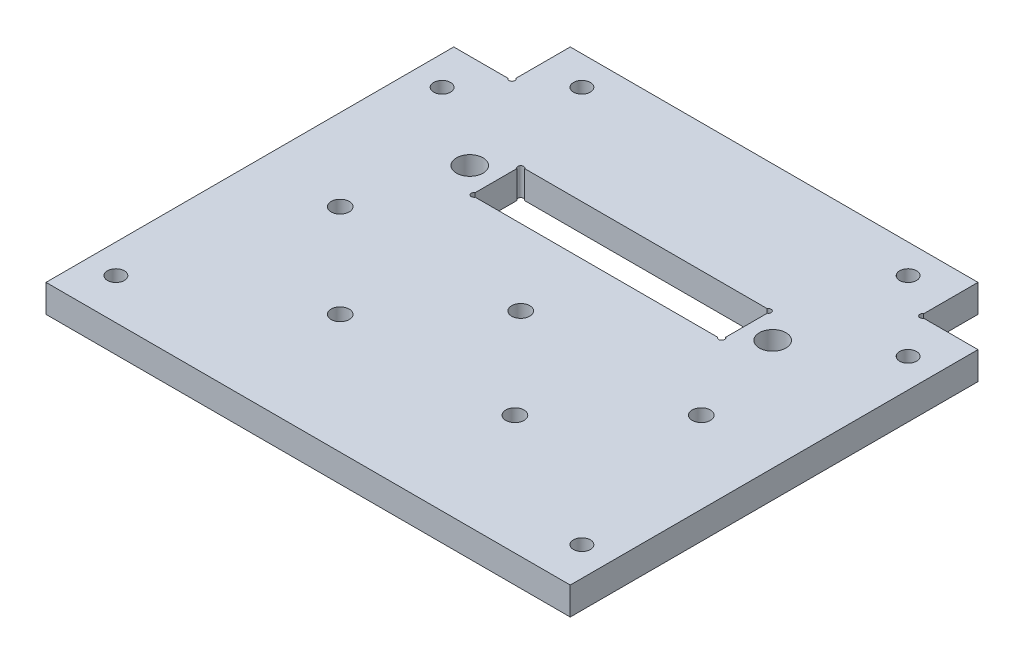
ISO-10303-21;
HEADER;
FILE_DESCRIPTION(('STEP AP214'),'2;1');
FILE_NAME('part.step','',(''),(''),'','','');
FILE_SCHEMA(('AUTOMOTIVE_DESIGN { 1 0 10303 214 1 1 1 1 }'));
ENDSEC;
DATA;
#1=APPLICATION_CONTEXT('core data for automotive mechanical design processes');
#2=APPLICATION_PROTOCOL_DEFINITION('international standard','automotive_design',2000,#1);
#3=PRODUCT_CONTEXT('',#1,'mechanical');
#4=PRODUCT('Part','Part','',(#3));
#5=PRODUCT_RELATED_PRODUCT_CATEGORY('part','',(#4));
#6=PRODUCT_DEFINITION_FORMATION('','',#4);
#7=PRODUCT_DEFINITION_CONTEXT('part definition',#1,'design');
#8=PRODUCT_DEFINITION('design','',#6,#7);
#9=PRODUCT_DEFINITION_SHAPE('','',#8);
#10=(LENGTH_UNIT() NAMED_UNIT(*) SI_UNIT(.MILLI.,.METRE.));
#11=(NAMED_UNIT(*) PLANE_ANGLE_UNIT() SI_UNIT($,.RADIAN.));
#12=(NAMED_UNIT(*) SI_UNIT($,.STERADIAN.) SOLID_ANGLE_UNIT());
#13=UNCERTAINTY_MEASURE_WITH_UNIT(LENGTH_MEASURE(1.E-05),#10,'distance_accuracy_value','');
#14=(GEOMETRIC_REPRESENTATION_CONTEXT(3) GLOBAL_UNCERTAINTY_ASSIGNED_CONTEXT((#13)) GLOBAL_UNIT_ASSIGNED_CONTEXT((#10,
#11,#12)) REPRESENTATION_CONTEXT('',''));
#15=CARTESIAN_POINT('',(0.,0.,0.));
#16=DIRECTION('',(0.,0.,1.));
#17=DIRECTION('',(1.,0.,0.));
#18=AXIS2_PLACEMENT_3D('',#15,#16,#17);
#19=CARTESIAN_POINT('',(-35.,4.7625,-10.));
#20=DIRECTION('',(1.,0.,0.));
#21=DIRECTION('',(0.,0.,-1.));
#22=AXIS2_PLACEMENT_3D('',#19,#20,#21);
#23=PLANE('',#22);
#24=DIRECTION('',(0.,0.,1.));
#25=VECTOR('',#24,1.);
#26=CARTESIAN_POINT('',(-35.,0.,-10.));
#27=LINE('',#26,#25);
#28=CARTESIAN_POINT('',(-35.,0.,-10.));
#29=VERTEX_POINT('',#28);
#30=CARTESIAN_POINT('',(-35.,0.,-0.683012701892218));
#31=VERTEX_POINT('',#30);
#32=EDGE_CURVE('E213',#29,#31,#27,.T.);
#33=ORIENTED_EDGE('',*,*,#32,.T.);
#34=DIRECTION('',(0.,1.,0.));
#35=VECTOR('',#34,1.);
#36=CARTESIAN_POINT('',(-35.,0.,-0.683012701892218));
#37=LINE('',#36,#35);
#38=CARTESIAN_POINT('',(-35.,4.7625,-0.683012701892218));
#39=VERTEX_POINT('',#38);
#40=EDGE_CURVE('E324',#31,#39,#37,.T.);
#41=ORIENTED_EDGE('',*,*,#40,.T.);
#42=DIRECTION('',(0.,0.,1.));
#43=VECTOR('',#42,1.);
#44=CARTESIAN_POINT('',(-35.,4.7625,-10.));
#45=LINE('',#44,#43);
#46=CARTESIAN_POINT('',(-35.,4.7625,-10.));
#47=VERTEX_POINT('',#46);
#48=EDGE_CURVE('E216',#47,#39,#45,.T.);
#49=ORIENTED_EDGE('',*,*,#48,.F.);
#50=DIRECTION('',(0.,-1.,0.));
#51=VECTOR('',#50,1.);
#52=CARTESIAN_POINT('',(-35.,4.7625,-10.));
#53=LINE('',#52,#51);
#54=EDGE_CURVE('E235',#47,#29,#53,.T.);
#55=ORIENTED_EDGE('',*,*,#54,.T.);
#56=EDGE_LOOP('',(#33,#41,#49,#55));
#57=FACE_BOUND('',#56,.T.);
#58=ADVANCED_FACE('F31',(#57),#23,.F.);
#59=CARTESIAN_POINT('',(-35.,4.7625,0.));
#60=DIRECTION('',(0.,0.,1.));
#61=DIRECTION('',(1.,0.,0.));
#62=AXIS2_PLACEMENT_3D('',#59,#60,#61);
#63=PLANE('',#62);
#64=DIRECTION('',(-1.,0.,0.));
#65=VECTOR('',#64,1.);
#66=CARTESIAN_POINT('',(-35.,4.7625,0.));
#67=LINE('',#66,#65);
#68=CARTESIAN_POINT('',(-35.6830127018922,4.7625,0.));
#69=VERTEX_POINT('',#68);
#70=CARTESIAN_POINT('',(-45.,4.7625,0.));
#71=VERTEX_POINT('',#70);
#72=EDGE_CURVE('E219',#69,#71,#67,.T.);
#73=ORIENTED_EDGE('',*,*,#72,.F.);
#74=DIRECTION('',(0.,1.,0.));
#75=VECTOR('',#74,1.);
#76=CARTESIAN_POINT('',(-35.6830127018922,0.,0.));
#77=LINE('',#76,#75);
#78=CARTESIAN_POINT('',(-35.6830127018922,0.,0.));
#79=VERTEX_POINT('',#78);
#80=EDGE_CURVE('E321',#69,#79,#77,.F.);
#81=ORIENTED_EDGE('',*,*,#80,.T.);
#82=DIRECTION('',(-1.,0.,0.));
#83=VECTOR('',#82,1.);
#84=CARTESIAN_POINT('',(-35.,0.,0.));
#85=LINE('',#84,#83);
#86=CARTESIAN_POINT('',(-45.,0.,0.));
#87=VERTEX_POINT('',#86);
#88=EDGE_CURVE('E238',#79,#87,#85,.T.);
#89=ORIENTED_EDGE('',*,*,#88,.T.);
#90=DIRECTION('',(0.,-1.,0.));
#91=VECTOR('',#90,1.);
#92=CARTESIAN_POINT('',(-45.,4.7625,0.));
#93=LINE('',#92,#91);
#94=EDGE_CURVE('E266',#71,#87,#93,.T.);
#95=ORIENTED_EDGE('',*,*,#94,.F.);
#96=EDGE_LOOP('',(#73,#81,#89,#95));
#97=FACE_BOUND('',#96,.T.);
#98=ADVANCED_FACE('F401',(#97),#63,.F.);
#99=CARTESIAN_POINT('',(-45.,4.7625,0.));
#100=DIRECTION('',(1.,0.,0.));
#101=DIRECTION('',(0.,0.,-1.));
#102=AXIS2_PLACEMENT_3D('',#99,#100,#101);
#103=PLANE('',#102);
#104=DIRECTION('',(0.,0.,1.));
#105=VECTOR('',#104,1.);
#106=CARTESIAN_POINT('',(-45.,0.,0.));
#107=LINE('',#106,#105);
#108=CARTESIAN_POINT('',(-45.,0.,70.));
#109=VERTEX_POINT('',#108);
#110=EDGE_CURVE('E240',#87,#109,#107,.T.);
#111=ORIENTED_EDGE('',*,*,#110,.T.);
#112=DIRECTION('',(0.,-1.,0.));
#113=VECTOR('',#112,1.);
#114=CARTESIAN_POINT('',(-45.,4.7625,70.));
#115=LINE('',#114,#113);
#116=CARTESIAN_POINT('',(-45.,4.7625,70.));
#117=VERTEX_POINT('',#116);
#118=EDGE_CURVE('E263',#117,#109,#115,.T.);
#119=ORIENTED_EDGE('',*,*,#118,.F.);
#120=DIRECTION('',(0.,0.,1.));
#121=VECTOR('',#120,1.);
#122=CARTESIAN_POINT('',(-45.,4.7625,0.));
#123=LINE('',#122,#121);
#124=EDGE_CURVE('E222',#71,#117,#123,.T.);
#125=ORIENTED_EDGE('',*,*,#124,.F.);
#126=ORIENTED_EDGE('',*,*,#94,.T.);
#127=EDGE_LOOP('',(#111,#119,#125,#126));
#128=FACE_BOUND('',#127,.T.);
#129=ADVANCED_FACE('F406',(#128),#103,.F.);
#130=CARTESIAN_POINT('',(45.,4.7625,70.));
#131=DIRECTION('',(0.,0.,-1.));
#132=DIRECTION('',(-1.,0.,0.));
#133=AXIS2_PLACEMENT_3D('',#130,#131,#132);
#134=PLANE('',#133);
#135=DIRECTION('',(1.,0.,0.));
#136=VECTOR('',#135,1.);
#137=CARTESIAN_POINT('',(45.,0.,70.));
#138=LINE('',#137,#136);
#139=CARTESIAN_POINT('',(45.,0.,70.));
#140=VERTEX_POINT('',#139);
#141=EDGE_CURVE('E242',#109,#140,#138,.T.);
#142=ORIENTED_EDGE('',*,*,#141,.T.);
#143=DIRECTION('',(0.,-1.,0.));
#144=VECTOR('',#143,1.);
#145=CARTESIAN_POINT('',(45.,4.7625,70.));
#146=LINE('',#145,#144);
#147=CARTESIAN_POINT('',(45.,4.7625,70.));
#148=VERTEX_POINT('',#147);
#149=EDGE_CURVE('E260',#148,#140,#146,.T.);
#150=ORIENTED_EDGE('',*,*,#149,.F.);
#151=DIRECTION('',(1.,0.,0.));
#152=VECTOR('',#151,1.);
#153=CARTESIAN_POINT('',(45.,4.7625,70.));
#154=LINE('',#153,#152);
#155=EDGE_CURVE('E224',#117,#148,#154,.T.);
#156=ORIENTED_EDGE('',*,*,#155,.F.);
#157=ORIENTED_EDGE('',*,*,#118,.T.);
#158=EDGE_LOOP('',(#142,#150,#156,#157));
#159=FACE_BOUND('',#158,.T.);
#160=ADVANCED_FACE('F446',(#159),#134,.F.);
#161=CARTESIAN_POINT('',(45.,4.7625,0.));
#162=DIRECTION('',(-1.,0.,0.));
#163=DIRECTION('',(0.,0.,1.));
#164=AXIS2_PLACEMENT_3D('',#161,#162,#163);
#165=PLANE('',#164);
#166=DIRECTION('',(0.,0.,-1.));
#167=VECTOR('',#166,1.);
#168=CARTESIAN_POINT('',(45.,0.,0.));
#169=LINE('',#168,#167);
#170=CARTESIAN_POINT('',(45.,0.,0.));
#171=VERTEX_POINT('',#170);
#172=EDGE_CURVE('E244',#140,#171,#169,.T.);
#173=ORIENTED_EDGE('',*,*,#172,.T.);
#174=DIRECTION('',(0.,-1.,0.));
#175=VECTOR('',#174,1.);
#176=CARTESIAN_POINT('',(45.,4.7625,0.));
#177=LINE('',#176,#175);
#178=CARTESIAN_POINT('',(45.,4.7625,0.));
#179=VERTEX_POINT('',#178);
#180=EDGE_CURVE('E257',#179,#171,#177,.T.);
#181=ORIENTED_EDGE('',*,*,#180,.F.);
#182=DIRECTION('',(0.,0.,-1.));
#183=VECTOR('',#182,1.);
#184=CARTESIAN_POINT('',(45.,4.7625,0.));
#185=LINE('',#184,#183);
#186=EDGE_CURVE('E226',#148,#179,#185,.T.);
#187=ORIENTED_EDGE('',*,*,#186,.F.);
#188=ORIENTED_EDGE('',*,*,#149,.T.);
#189=EDGE_LOOP('',(#173,#181,#187,#188));
#190=FACE_BOUND('',#189,.T.);
#191=ADVANCED_FACE('F442',(#190),#165,.F.);
#192=CARTESIAN_POINT('',(45.,4.7625,0.));
#193=DIRECTION('',(0.,0.,1.));
#194=DIRECTION('',(1.,0.,0.));
#195=AXIS2_PLACEMENT_3D('',#192,#193,#194);
#196=PLANE('',#195);
#197=DIRECTION('',(-1.,0.,0.));
#198=VECTOR('',#197,1.);
#199=CARTESIAN_POINT('',(45.,0.,0.));
#200=LINE('',#199,#198);
#201=CARTESIAN_POINT('',(35.6830127018922,0.,0.));
#202=VERTEX_POINT('',#201);
#203=EDGE_CURVE('E246',#171,#202,#200,.T.);
#204=ORIENTED_EDGE('',*,*,#203,.T.);
#205=DIRECTION('',(0.,1.,0.));
#206=VECTOR('',#205,1.);
#207=CARTESIAN_POINT('',(35.6830127018922,0.,0.));
#208=LINE('',#207,#206);
#209=CARTESIAN_POINT('',(35.6830127018922,4.7625,0.));
#210=VERTEX_POINT('',#209);
#211=EDGE_CURVE('E300',#202,#210,#208,.T.);
#212=ORIENTED_EDGE('',*,*,#211,.T.);
#213=DIRECTION('',(-1.,0.,0.));
#214=VECTOR('',#213,1.);
#215=CARTESIAN_POINT('',(45.,4.7625,0.));
#216=LINE('',#215,#214);
#217=EDGE_CURVE('E228',#179,#210,#216,.T.);
#218=ORIENTED_EDGE('',*,*,#217,.F.);
#219=ORIENTED_EDGE('',*,*,#180,.T.);
#220=EDGE_LOOP('',(#204,#212,#218,#219));
#221=FACE_BOUND('',#220,.T.);
#222=ADVANCED_FACE('F437',(#221),#196,.F.);
#223=CARTESIAN_POINT('',(35.,4.7625,-10.));
#224=DIRECTION('',(-1.,0.,0.));
#225=DIRECTION('',(0.,0.,1.));
#226=AXIS2_PLACEMENT_3D('',#223,#224,#225);
#227=PLANE('',#226);
#228=DIRECTION('',(0.,0.,-1.));
#229=VECTOR('',#228,1.);
#230=CARTESIAN_POINT('',(35.,4.7625,-10.));
#231=LINE('',#230,#229);
#232=CARTESIAN_POINT('',(35.,4.7625,-0.683012701892218));
#233=VERTEX_POINT('',#232);
#234=CARTESIAN_POINT('',(35.,4.7625,-10.));
#235=VERTEX_POINT('',#234);
#236=EDGE_CURVE('E231',#233,#235,#231,.T.);
#237=ORIENTED_EDGE('',*,*,#236,.F.);
#238=DIRECTION('',(0.,1.,0.));
#239=VECTOR('',#238,1.);
#240=CARTESIAN_POINT('',(35.,0.,-0.683012701892218));
#241=LINE('',#240,#239);
#242=CARTESIAN_POINT('',(35.,0.,-0.683012701892218));
#243=VERTEX_POINT('',#242);
#244=EDGE_CURVE('E296',#233,#243,#241,.F.);
#245=ORIENTED_EDGE('',*,*,#244,.T.);
#246=DIRECTION('',(0.,0.,-1.));
#247=VECTOR('',#246,1.);
#248=CARTESIAN_POINT('',(35.,0.,-10.));
#249=LINE('',#248,#247);
#250=CARTESIAN_POINT('',(35.,0.,-10.));
#251=VERTEX_POINT('',#250);
#252=EDGE_CURVE('E249',#243,#251,#249,.T.);
#253=ORIENTED_EDGE('',*,*,#252,.T.);
#254=DIRECTION('',(0.,-1.,0.));
#255=VECTOR('',#254,1.);
#256=CARTESIAN_POINT('',(35.,4.7625,-10.));
#257=LINE('',#256,#255);
#258=EDGE_CURVE('E254',#235,#251,#257,.T.);
#259=ORIENTED_EDGE('',*,*,#258,.F.);
#260=EDGE_LOOP('',(#237,#245,#253,#259));
#261=FACE_BOUND('',#260,.T.);
#262=ADVANCED_FACE('F432',(#261),#227,.F.);
#263=CARTESIAN_POINT('',(-35.,4.7625,-10.));
#264=DIRECTION('',(0.,0.,1.));
#265=DIRECTION('',(1.,0.,0.));
#266=AXIS2_PLACEMENT_3D('',#263,#264,#265);
#267=PLANE('',#266);
#268=DIRECTION('',(-1.,0.,0.));
#269=VECTOR('',#268,1.);
#270=CARTESIAN_POINT('',(-35.,0.,-10.));
#271=LINE('',#270,#269);
#272=EDGE_CURVE('E220',#251,#29,#271,.T.);
#273=ORIENTED_EDGE('',*,*,#272,.T.);
#274=ORIENTED_EDGE('',*,*,#54,.F.);
#275=DIRECTION('',(-1.,0.,0.));
#276=VECTOR('',#275,1.);
#277=CARTESIAN_POINT('',(-35.,4.7625,-10.));
#278=LINE('',#277,#276);
#279=EDGE_CURVE('E233',#235,#47,#278,.T.);
#280=ORIENTED_EDGE('',*,*,#279,.F.);
#281=ORIENTED_EDGE('',*,*,#258,.T.);
#282=EDGE_LOOP('',(#273,#274,#280,#281));
#283=FACE_BOUND('',#282,.T.);
#284=ADVANCED_FACE('F430',(#283),#267,.F.);
#285=CARTESIAN_POINT('',(-35.,4.7625,0.));
#286=DIRECTION('',(0.,-1.,0.));
#287=DIRECTION('',(0.,0.,-1.));
#288=AXIS2_PLACEMENT_3D('',#285,#286,#287);
#289=PLANE('',#288);
#290=CARTESIAN_POINT('',(28.,4.7625,-5.));
#291=DIRECTION('',(0.,1.,0.));
#292=DIRECTION('',(0.,0.,-1.));
#293=AXIS2_PLACEMENT_3D('',#290,#291,#292);
#294=CIRCLE('',#293,1.45);
#295=CARTESIAN_POINT('',(28.,4.7625,-6.45));
#296=VERTEX_POINT('',#295);
#297=EDGE_CURVE('E327',#296,#296,#294,.T.);
#298=ORIENTED_EDGE('',*,*,#297,.F.);
#299=EDGE_LOOP('',(#298));
#300=FACE_BOUND('',#299,.T.);
#301=CARTESIAN_POINT('',(40.,4.7625,7.));
#302=DIRECTION('',(0.,1.,0.));
#303=DIRECTION('',(0.,0.,-1.));
#304=AXIS2_PLACEMENT_3D('',#301,#302,#303);
#305=CIRCLE('',#304,1.45);
#306=CARTESIAN_POINT('',(40.,4.7625,5.55));
#307=VERTEX_POINT('',#306);
#308=EDGE_CURVE('E331',#307,#307,#305,.T.);
#309=ORIENTED_EDGE('',*,*,#308,.F.);
#310=EDGE_LOOP('',(#309));
#311=FACE_BOUND('',#310,.T.);
#312=CARTESIAN_POINT('',(40.,4.7625,63.));
#313=DIRECTION('',(0.,1.,0.));
#314=DIRECTION('',(0.,0.,-1.));
#315=AXIS2_PLACEMENT_3D('',#312,#313,#314);
#316=CIRCLE('',#315,1.45);
#317=CARTESIAN_POINT('',(40.,4.7625,61.55));
#318=VERTEX_POINT('',#317);
#319=EDGE_CURVE('E337',#318,#318,#316,.T.);
#320=ORIENTED_EDGE('',*,*,#319,.F.);
#321=EDGE_LOOP('',(#320));
#322=FACE_BOUND('',#321,.T.);
#323=CARTESIAN_POINT('',(-40.,4.7625,63.));
#324=DIRECTION('',(0.,1.,0.));
#325=DIRECTION('',(0.,0.,1.));
#326=AXIS2_PLACEMENT_3D('',#323,#324,#325);
#327=CIRCLE('',#326,1.45);
#328=CARTESIAN_POINT('',(-40.,4.7625,64.45));
#329=VERTEX_POINT('',#328);
#330=EDGE_CURVE('E343',#329,#329,#327,.T.);
#331=ORIENTED_EDGE('',*,*,#330,.F.);
#332=EDGE_LOOP('',(#331));
#333=FACE_BOUND('',#332,.T.);
#334=CARTESIAN_POINT('',(-40.,4.7625,7.));
#335=DIRECTION('',(0.,1.,0.));
#336=DIRECTION('',(0.,0.,1.));
#337=AXIS2_PLACEMENT_3D('',#334,#335,#336);
#338=CIRCLE('',#337,1.45);
#339=CARTESIAN_POINT('',(-40.,4.7625,8.45));
#340=VERTEX_POINT('',#339);
#341=EDGE_CURVE('E349',#340,#340,#338,.T.);
#342=ORIENTED_EDGE('',*,*,#341,.F.);
#343=EDGE_LOOP('',(#342));
#344=FACE_BOUND('',#343,.T.);
#345=CARTESIAN_POINT('',(-28.,4.7625,-5.));
#346=DIRECTION('',(0.,1.,0.));
#347=DIRECTION('',(0.,0.,1.));
#348=AXIS2_PLACEMENT_3D('',#345,#346,#347);
#349=CIRCLE('',#348,1.45);
#350=CARTESIAN_POINT('',(-28.,4.7625,-3.55));
#351=VERTEX_POINT('',#350);
#352=EDGE_CURVE('E355',#351,#351,#349,.T.);
#353=ORIENTED_EDGE('',*,*,#352,.F.);
#354=EDGE_LOOP('',(#353));
#355=FACE_BOUND('',#354,.T.);
#356=CARTESIAN_POINT('',(26.,4.7625,16.25));
#357=DIRECTION('',(0.,1.,0.));
#358=DIRECTION('',(0.,0.,1.));
#359=AXIS2_PLACEMENT_3D('',#356,#357,#358);
#360=CIRCLE('',#359,2.28599999999999);
#361=CARTESIAN_POINT('',(26.,4.7625,18.536));
#362=VERTEX_POINT('',#361);
#363=EDGE_CURVE('E361',#362,#362,#360,.T.);
#364=ORIENTED_EDGE('',*,*,#363,.F.);
#365=EDGE_LOOP('',(#364));
#366=FACE_BOUND('',#365,.T.);
#367=CARTESIAN_POINT('',(-26.,4.7625,16.25));
#368=DIRECTION('',(0.,1.,0.));
#369=DIRECTION('',(0.,0.,1.));
#370=AXIS2_PLACEMENT_3D('',#367,#368,#369);
#371=CIRCLE('',#370,2.286);
#372=CARTESIAN_POINT('',(-26.,4.7625,18.536));
#373=VERTEX_POINT('',#372);
#374=EDGE_CURVE('E367',#373,#373,#371,.T.);
#375=ORIENTED_EDGE('',*,*,#374,.F.);
#376=EDGE_LOOP('',(#375));
#377=FACE_BOUND('',#376,.T.);
#378=DIRECTION('',(0.,0.,-1.));
#379=VECTOR('',#378,1.);
#380=CARTESIAN_POINT('',(21.5,4.7625,12.));
#381=LINE('',#380,#379);
#382=CARTESIAN_POINT('',(21.5,4.7625,19.8169872981078));
#383=VERTEX_POINT('',#382);
#384=CARTESIAN_POINT('',(21.5,4.7625,12.6830127018922));
#385=VERTEX_POINT('',#384);
#386=EDGE_CURVE('E168',#383,#385,#381,.T.);
#387=ORIENTED_EDGE('',*,*,#386,.F.);
#388=CARTESIAN_POINT('',(21.25,4.7625,20.25));
#389=DIRECTION('',(0.,1.,0.));
#390=DIRECTION('',(0.,0.,-1.));
#391=AXIS2_PLACEMENT_3D('',#388,#389,#390);
#392=CIRCLE('',#391,0.499999999999999);
#393=CARTESIAN_POINT('',(20.8169872981078,4.7625,20.5));
#394=VERTEX_POINT('',#393);
#395=EDGE_CURVE('E154',#394,#383,#392,.T.);
#396=ORIENTED_EDGE('',*,*,#395,.F.);
#397=DIRECTION('',(1.,0.,0.));
#398=VECTOR('',#397,1.);
#399=CARTESIAN_POINT('',(-21.5,4.7625,20.5));
#400=LINE('',#399,#398);
#401=CARTESIAN_POINT('',(-20.8169872981078,4.7625,20.5));
#402=VERTEX_POINT('',#401);
#403=EDGE_CURVE('E166',#402,#394,#400,.T.);
#404=ORIENTED_EDGE('',*,*,#403,.F.);
#405=CARTESIAN_POINT('',(-21.25,4.7625,20.25));
#406=DIRECTION('',(0.,1.,0.));
#407=DIRECTION('',(0.,0.,1.));
#408=AXIS2_PLACEMENT_3D('',#405,#406,#407);
#409=CIRCLE('',#408,0.499999999999999);
#410=CARTESIAN_POINT('',(-21.5,4.7625,19.8169872981078));
#411=VERTEX_POINT('',#410);
#412=EDGE_CURVE('E303',#411,#402,#409,.T.);
#413=ORIENTED_EDGE('',*,*,#412,.F.);
#414=DIRECTION('',(0.,0.,1.));
#415=VECTOR('',#414,1.);
#416=CARTESIAN_POINT('',(-21.5,4.7625,12.));
#417=LINE('',#416,#415);
#418=CARTESIAN_POINT('',(-21.5,4.7625,12.6830127018922));
#419=VERTEX_POINT('',#418);
#420=EDGE_CURVE('E173',#419,#411,#417,.T.);
#421=ORIENTED_EDGE('',*,*,#420,.F.);
#422=CARTESIAN_POINT('',(-21.25,4.7625,12.25));
#423=DIRECTION('',(0.,1.,0.));
#424=DIRECTION('',(0.,0.,1.));
#425=AXIS2_PLACEMENT_3D('',#422,#423,#424);
#426=CIRCLE('',#425,0.499999999999999);
#427=CARTESIAN_POINT('',(-20.8169872981078,4.7625,12.));
#428=VERTEX_POINT('',#427);
#429=EDGE_CURVE('E311',#428,#419,#426,.T.);
#430=ORIENTED_EDGE('',*,*,#429,.F.);
#431=DIRECTION('',(-1.,0.,0.));
#432=VECTOR('',#431,1.);
#433=CARTESIAN_POINT('',(-21.5,4.7625,12.));
#434=LINE('',#433,#432);
#435=CARTESIAN_POINT('',(20.8169872981078,4.7625,12.));
#436=VERTEX_POINT('',#435);
#437=EDGE_CURVE('E175',#436,#428,#434,.T.);
#438=ORIENTED_EDGE('',*,*,#437,.F.);
#439=CARTESIAN_POINT('',(21.25,4.7625,12.25));
#440=DIRECTION('',(0.,1.,0.));
#441=DIRECTION('',(0.,0.,-1.));
#442=AXIS2_PLACEMENT_3D('',#439,#440,#441);
#443=CIRCLE('',#442,0.499999999999999);
#444=EDGE_CURVE('E280',#385,#436,#443,.T.);
#445=ORIENTED_EDGE('',*,*,#444,.F.);
#446=EDGE_LOOP('',(#387,#396,#404,#413,#421,#430,#438,#445));
#447=FACE_BOUND('',#446,.T.);
#448=CARTESIAN_POINT('',(-15.,4.7625,49.5));
#449=DIRECTION('',(0.,1.,0.));
#450=DIRECTION('',(0.,0.,1.));
#451=AXIS2_PLACEMENT_3D('',#448,#449,#450);
#452=CIRCLE('',#451,1.5625);
#453=CARTESIAN_POINT('',(-15.,4.7625,51.0625));
#454=VERTEX_POINT('',#453);
#455=EDGE_CURVE('E188',#454,#454,#452,.T.);
#456=ORIENTED_EDGE('',*,*,#455,.F.);
#457=EDGE_LOOP('',(#456));
#458=FACE_BOUND('',#457,.T.);
#459=CARTESIAN_POINT('',(15.,4.7625,49.5));
#460=DIRECTION('',(0.,1.,0.));
#461=DIRECTION('',(0.,0.,1.));
#462=AXIS2_PLACEMENT_3D('',#459,#460,#461);
#463=CIRCLE('',#462,1.5625);
#464=CARTESIAN_POINT('',(15.,4.7625,51.0625));
#465=VERTEX_POINT('',#464);
#466=EDGE_CURVE('E187',#465,#465,#463,.T.);
#467=ORIENTED_EDGE('',*,*,#466,.F.);
#468=EDGE_LOOP('',(#467));
#469=FACE_BOUND('',#468,.T.);
#470=CARTESIAN_POINT('',(31.,4.7625,33.5));
#471=DIRECTION('',(0.,1.,0.));
#472=DIRECTION('',(0.,0.,1.));
#473=AXIS2_PLACEMENT_3D('',#470,#471,#472);
#474=CIRCLE('',#473,1.56249999999999);
#475=CARTESIAN_POINT('',(31.,4.7625,35.0625));
#476=VERTEX_POINT('',#475);
#477=EDGE_CURVE('E195',#476,#476,#474,.T.);
#478=ORIENTED_EDGE('',*,*,#477,.F.);
#479=EDGE_LOOP('',(#478));
#480=FACE_BOUND('',#479,.T.);
#481=CARTESIAN_POINT('',(0.,4.7625,33.5));
#482=DIRECTION('',(0.,1.,0.));
#483=DIRECTION('',(0.,0.,1.));
#484=AXIS2_PLACEMENT_3D('',#481,#482,#483);
#485=CIRCLE('',#484,1.5625);
#486=CARTESIAN_POINT('',(0.,4.7625,35.0625));
#487=VERTEX_POINT('',#486);
#488=EDGE_CURVE('E201',#487,#487,#485,.T.);
#489=ORIENTED_EDGE('',*,*,#488,.F.);
#490=EDGE_LOOP('',(#489));
#491=FACE_BOUND('',#490,.T.);
#492=CARTESIAN_POINT('',(-31.,4.7625,33.5));
#493=DIRECTION('',(0.,1.,0.));
#494=DIRECTION('',(0.,0.,1.));
#495=AXIS2_PLACEMENT_3D('',#492,#493,#494);
#496=CIRCLE('',#495,1.5625);
#497=CARTESIAN_POINT('',(-31.,4.7625,35.0625));
#498=VERTEX_POINT('',#497);
#499=EDGE_CURVE('E207',#498,#498,#496,.T.);
#500=ORIENTED_EDGE('',*,*,#499,.F.);
#501=EDGE_LOOP('',(#500));
#502=FACE_BOUND('',#501,.T.);
#503=ORIENTED_EDGE('',*,*,#217,.T.);
#504=CARTESIAN_POINT('',(35.25,4.7625,-0.25));
#505=DIRECTION('',(0.,1.,0.));
#506=DIRECTION('',(0.,0.,-1.));
#507=AXIS2_PLACEMENT_3D('',#504,#505,#506);
#508=CIRCLE('',#507,0.499999999999999);
#509=EDGE_CURVE('E292',#233,#210,#508,.T.);
#510=ORIENTED_EDGE('',*,*,#509,.F.);
#511=ORIENTED_EDGE('',*,*,#236,.T.);
#512=ORIENTED_EDGE('',*,*,#279,.T.);
#513=ORIENTED_EDGE('',*,*,#48,.T.);
#514=CARTESIAN_POINT('',(-35.25,4.7625,-0.25));
#515=DIRECTION('',(0.,1.,0.));
#516=DIRECTION('',(0.,0.,1.));
#517=AXIS2_PLACEMENT_3D('',#514,#515,#516);
#518=CIRCLE('',#517,0.499999999999999);
#519=EDGE_CURVE('E319',#69,#39,#518,.T.);
#520=ORIENTED_EDGE('',*,*,#519,.F.);
#521=ORIENTED_EDGE('',*,*,#72,.T.);
#522=ORIENTED_EDGE('',*,*,#124,.T.);
#523=ORIENTED_EDGE('',*,*,#155,.T.);
#524=ORIENTED_EDGE('',*,*,#186,.T.);
#525=EDGE_LOOP('',(#503,#510,#511,#512,#513,#520,#521,#522,#523,#524));
#526=FACE_BOUND('',#525,.T.);
#527=ADVANCED_FACE('F163',(#300,#311,#322,#333,#344,#355,#366,#377,#447,#458,#469,#480,#491,
#502,#526),#289,.F.);
#528=CARTESIAN_POINT('',(-35.,0.,0.));
#529=DIRECTION('',(0.,-1.,0.));
#530=DIRECTION('',(0.,0.,-1.));
#531=AXIS2_PLACEMENT_3D('',#528,#529,#530);
#532=PLANE('',#531);
#533=CARTESIAN_POINT('',(21.25,0.,20.25));
#534=DIRECTION('',(0.,1.,0.));
#535=DIRECTION('',(0.,0.,-1.));
#536=AXIS2_PLACEMENT_3D('',#533,#534,#535);
#537=CIRCLE('',#536,0.499999999999999);
#538=CARTESIAN_POINT('',(20.8169872981078,0.,20.5));
#539=VERTEX_POINT('',#538);
#540=CARTESIAN_POINT('',(21.5,0.,19.8169872981078));
#541=VERTEX_POINT('',#540);
#542=EDGE_CURVE('E45',#539,#541,#537,.T.);
#543=ORIENTED_EDGE('',*,*,#542,.T.);
#544=DIRECTION('',(0.,0.,-1.));
#545=VECTOR('',#544,1.);
#546=CARTESIAN_POINT('',(21.5,0.,12.));
#547=LINE('',#546,#545);
#548=CARTESIAN_POINT('',(21.5,0.,12.6830127018922));
#549=VERTEX_POINT('',#548);
#550=EDGE_CURVE('E51',#541,#549,#547,.T.);
#551=ORIENTED_EDGE('',*,*,#550,.T.);
#552=CARTESIAN_POINT('',(21.25,0.,12.25));
#553=DIRECTION('',(0.,1.,0.));
#554=DIRECTION('',(0.,0.,-1.));
#555=AXIS2_PLACEMENT_3D('',#552,#553,#554);
#556=CIRCLE('',#555,0.499999999999999);
#557=CARTESIAN_POINT('',(20.8169872981078,0.,12.));
#558=VERTEX_POINT('',#557);
#559=EDGE_CURVE('E282',#549,#558,#556,.T.);
#560=ORIENTED_EDGE('',*,*,#559,.T.);
#561=DIRECTION('',(-1.,0.,0.));
#562=VECTOR('',#561,1.);
#563=CARTESIAN_POINT('',(-21.5,0.,12.));
#564=LINE('',#563,#562);
#565=CARTESIAN_POINT('',(-20.8169872981078,0.,12.));
#566=VERTEX_POINT('',#565);
#567=EDGE_CURVE('E191',#558,#566,#564,.T.);
#568=ORIENTED_EDGE('',*,*,#567,.T.);
#569=CARTESIAN_POINT('',(-21.25,0.,12.25));
#570=DIRECTION('',(0.,1.,0.));
#571=DIRECTION('',(0.,0.,1.));
#572=AXIS2_PLACEMENT_3D('',#569,#570,#571);
#573=CIRCLE('',#572,0.499999999999999);
#574=CARTESIAN_POINT('',(-21.5,0.,12.6830127018922));
#575=VERTEX_POINT('',#574);
#576=EDGE_CURVE('E312',#566,#575,#573,.T.);
#577=ORIENTED_EDGE('',*,*,#576,.T.);
#578=DIRECTION('',(0.,0.,1.));
#579=VECTOR('',#578,1.);
#580=CARTESIAN_POINT('',(-21.5,0.,12.));
#581=LINE('',#580,#579);
#582=CARTESIAN_POINT('',(-21.5,0.,19.8169872981078));
#583=VERTEX_POINT('',#582);
#584=EDGE_CURVE('E183',#575,#583,#581,.T.);
#585=ORIENTED_EDGE('',*,*,#584,.T.);
#586=CARTESIAN_POINT('',(-21.25,0.,20.25));
#587=DIRECTION('',(0.,1.,0.));
#588=DIRECTION('',(0.,0.,1.));
#589=AXIS2_PLACEMENT_3D('',#586,#587,#588);
#590=CIRCLE('',#589,0.499999999999999);
#591=CARTESIAN_POINT('',(-20.8169872981078,0.,20.5));
#592=VERTEX_POINT('',#591);
#593=EDGE_CURVE('E304',#583,#592,#590,.T.);
#594=ORIENTED_EDGE('',*,*,#593,.T.);
#595=DIRECTION('',(1.,0.,0.));
#596=VECTOR('',#595,1.);
#597=CARTESIAN_POINT('',(-21.5,0.,20.5));
#598=LINE('',#597,#596);
#599=EDGE_CURVE('E376',#592,#539,#598,.T.);
#600=ORIENTED_EDGE('',*,*,#599,.T.);
#601=EDGE_LOOP('',(#543,#551,#560,#568,#577,#585,#594,#600));
#602=FACE_BOUND('',#601,.T.);
#603=CARTESIAN_POINT('',(35.25,0.,-0.25));
#604=DIRECTION('',(0.,1.,0.));
#605=DIRECTION('',(0.,0.,-1.));
#606=AXIS2_PLACEMENT_3D('',#603,#604,#605);
#607=CIRCLE('',#606,0.499999999999999);
#608=EDGE_CURVE('E293',#243,#202,#607,.T.);
#609=ORIENTED_EDGE('',*,*,#608,.T.);
#610=ORIENTED_EDGE('',*,*,#203,.F.);
#611=ORIENTED_EDGE('',*,*,#172,.F.);
#612=ORIENTED_EDGE('',*,*,#141,.F.);
#613=ORIENTED_EDGE('',*,*,#110,.F.);
#614=ORIENTED_EDGE('',*,*,#88,.F.);
#615=CARTESIAN_POINT('',(-35.25,0.,-0.25));
#616=DIRECTION('',(0.,-1.,0.));
#617=DIRECTION('',(0.,0.,-1.));
#618=AXIS2_PLACEMENT_3D('',#615,#616,#617);
#619=CIRCLE('',#618,0.499999999999999);
#620=EDGE_CURVE('E269',#31,#79,#619,.T.);
#621=ORIENTED_EDGE('',*,*,#620,.F.);
#622=ORIENTED_EDGE('',*,*,#32,.F.);
#623=ORIENTED_EDGE('',*,*,#272,.F.);
#624=ORIENTED_EDGE('',*,*,#252,.F.);
#625=EDGE_LOOP('',(#609,#610,#611,#612,#613,#614,#621,#622,#623,#624));
#626=FACE_BOUND('',#625,.T.);
#627=CARTESIAN_POINT('',(28.,0.,-5.));
#628=DIRECTION('',(0.,1.,0.));
#629=DIRECTION('',(0.,0.,-1.));
#630=AXIS2_PLACEMENT_3D('',#627,#628,#629);
#631=CIRCLE('',#630,1.45);
#632=CARTESIAN_POINT('',(28.,0.,-6.45));
#633=VERTEX_POINT('',#632);
#634=EDGE_CURVE('E328',#633,#633,#631,.T.);
#635=ORIENTED_EDGE('',*,*,#634,.T.);
#636=EDGE_LOOP('',(#635));
#637=FACE_BOUND('',#636,.T.);
#638=CARTESIAN_POINT('',(40.,0.,7.));
#639=DIRECTION('',(0.,1.,0.));
#640=DIRECTION('',(0.,0.,-1.));
#641=AXIS2_PLACEMENT_3D('',#638,#639,#640);
#642=CIRCLE('',#641,1.45);
#643=CARTESIAN_POINT('',(40.,0.,5.55));
#644=VERTEX_POINT('',#643);
#645=EDGE_CURVE('E334',#644,#644,#642,.T.);
#646=ORIENTED_EDGE('',*,*,#645,.T.);
#647=EDGE_LOOP('',(#646));
#648=FACE_BOUND('',#647,.T.);
#649=CARTESIAN_POINT('',(40.,0.,63.));
#650=DIRECTION('',(0.,1.,0.));
#651=DIRECTION('',(0.,0.,-1.));
#652=AXIS2_PLACEMENT_3D('',#649,#650,#651);
#653=CIRCLE('',#652,1.45);
#654=CARTESIAN_POINT('',(40.,0.,61.55));
#655=VERTEX_POINT('',#654);
#656=EDGE_CURVE('E340',#655,#655,#653,.T.);
#657=ORIENTED_EDGE('',*,*,#656,.T.);
#658=EDGE_LOOP('',(#657));
#659=FACE_BOUND('',#658,.T.);
#660=CARTESIAN_POINT('',(-40.,0.,63.));
#661=DIRECTION('',(0.,1.,0.));
#662=DIRECTION('',(0.,0.,1.));
#663=AXIS2_PLACEMENT_3D('',#660,#661,#662);
#664=CIRCLE('',#663,1.45);
#665=CARTESIAN_POINT('',(-40.,0.,64.45));
#666=VERTEX_POINT('',#665);
#667=EDGE_CURVE('E346',#666,#666,#664,.T.);
#668=ORIENTED_EDGE('',*,*,#667,.T.);
#669=EDGE_LOOP('',(#668));
#670=FACE_BOUND('',#669,.T.);
#671=CARTESIAN_POINT('',(-40.,0.,7.));
#672=DIRECTION('',(0.,1.,0.));
#673=DIRECTION('',(0.,0.,1.));
#674=AXIS2_PLACEMENT_3D('',#671,#672,#673);
#675=CIRCLE('',#674,1.45);
#676=CARTESIAN_POINT('',(-40.,0.,8.45));
#677=VERTEX_POINT('',#676);
#678=EDGE_CURVE('E352',#677,#677,#675,.T.);
#679=ORIENTED_EDGE('',*,*,#678,.T.);
#680=EDGE_LOOP('',(#679));
#681=FACE_BOUND('',#680,.T.);
#682=CARTESIAN_POINT('',(-28.,0.,-5.));
#683=DIRECTION('',(0.,1.,0.));
#684=DIRECTION('',(0.,0.,1.));
#685=AXIS2_PLACEMENT_3D('',#682,#683,#684);
#686=CIRCLE('',#685,1.45);
#687=CARTESIAN_POINT('',(-28.,0.,-3.55));
#688=VERTEX_POINT('',#687);
#689=EDGE_CURVE('E358',#688,#688,#686,.T.);
#690=ORIENTED_EDGE('',*,*,#689,.T.);
#691=EDGE_LOOP('',(#690));
#692=FACE_BOUND('',#691,.T.);
#693=CARTESIAN_POINT('',(26.,0.,16.25));
#694=DIRECTION('',(0.,1.,0.));
#695=DIRECTION('',(0.,0.,1.));
#696=AXIS2_PLACEMENT_3D('',#693,#694,#695);
#697=CIRCLE('',#696,2.28599999999999);
#698=CARTESIAN_POINT('',(26.,0.,18.536));
#699=VERTEX_POINT('',#698);
#700=EDGE_CURVE('E364',#699,#699,#697,.T.);
#701=ORIENTED_EDGE('',*,*,#700,.T.);
#702=EDGE_LOOP('',(#701));
#703=FACE_BOUND('',#702,.T.);
#704=CARTESIAN_POINT('',(-26.,0.,16.25));
#705=DIRECTION('',(0.,1.,0.));
#706=DIRECTION('',(0.,0.,1.));
#707=AXIS2_PLACEMENT_3D('',#704,#705,#706);
#708=CIRCLE('',#707,2.286);
#709=CARTESIAN_POINT('',(-26.,0.,18.536));
#710=VERTEX_POINT('',#709);
#711=EDGE_CURVE('E178',#710,#710,#708,.T.);
#712=ORIENTED_EDGE('',*,*,#711,.T.);
#713=EDGE_LOOP('',(#712));
#714=FACE_BOUND('',#713,.T.);
#715=CARTESIAN_POINT('',(-15.,0.,49.5));
#716=DIRECTION('',(0.,1.,0.));
#717=DIRECTION('',(0.,0.,1.));
#718=AXIS2_PLACEMENT_3D('',#715,#716,#717);
#719=CIRCLE('',#718,1.5625);
#720=CARTESIAN_POINT('',(-15.,0.,51.0625));
#721=VERTEX_POINT('',#720);
#722=EDGE_CURVE('E184',#721,#721,#719,.T.);
#723=ORIENTED_EDGE('',*,*,#722,.T.);
#724=EDGE_LOOP('',(#723));
#725=FACE_BOUND('',#724,.T.);
#726=CARTESIAN_POINT('',(15.,0.,49.5));
#727=DIRECTION('',(0.,1.,0.));
#728=DIRECTION('',(0.,0.,1.));
#729=AXIS2_PLACEMENT_3D('',#726,#727,#728);
#730=CIRCLE('',#729,1.5625);
#731=CARTESIAN_POINT('',(15.,0.,51.0625));
#732=VERTEX_POINT('',#731);
#733=EDGE_CURVE('E192',#732,#732,#730,.T.);
#734=ORIENTED_EDGE('',*,*,#733,.T.);
#735=EDGE_LOOP('',(#734));
#736=FACE_BOUND('',#735,.T.);
#737=CARTESIAN_POINT('',(31.,0.,33.5));
#738=DIRECTION('',(0.,1.,0.));
#739=DIRECTION('',(0.,0.,1.));
#740=AXIS2_PLACEMENT_3D('',#737,#738,#739);
#741=CIRCLE('',#740,1.56249999999999);
#742=CARTESIAN_POINT('',(31.,0.,35.0625));
#743=VERTEX_POINT('',#742);
#744=EDGE_CURVE('E198',#743,#743,#741,.T.);
#745=ORIENTED_EDGE('',*,*,#744,.T.);
#746=EDGE_LOOP('',(#745));
#747=FACE_BOUND('',#746,.T.);
#748=CARTESIAN_POINT('',(0.,0.,33.5));
#749=DIRECTION('',(0.,1.,0.));
#750=DIRECTION('',(0.,0.,1.));
#751=AXIS2_PLACEMENT_3D('',#748,#749,#750);
#752=CIRCLE('',#751,1.5625);
#753=CARTESIAN_POINT('',(0.,0.,35.0625));
#754=VERTEX_POINT('',#753);
#755=EDGE_CURVE('E204',#754,#754,#752,.T.);
#756=ORIENTED_EDGE('',*,*,#755,.T.);
#757=EDGE_LOOP('',(#756));
#758=FACE_BOUND('',#757,.T.);
#759=CARTESIAN_POINT('',(-31.,0.,33.5));
#760=DIRECTION('',(0.,1.,0.));
#761=DIRECTION('',(0.,0.,1.));
#762=AXIS2_PLACEMENT_3D('',#759,#760,#761);
#763=CIRCLE('',#762,1.5625);
#764=CARTESIAN_POINT('',(-31.,0.,35.0625));
#765=VERTEX_POINT('',#764);
#766=EDGE_CURVE('E210',#765,#765,#763,.T.);
#767=ORIENTED_EDGE('',*,*,#766,.T.);
#768=EDGE_LOOP('',(#767));
#769=FACE_BOUND('',#768,.T.);
#770=ADVANCED_FACE('F380',(#602,#626,#637,#648,#659,#670,#681,#692,#703,#714,#725,#736,#747,
#758,#769),#532,.T.);
#771=CARTESIAN_POINT('',(-31.,0.,33.5));
#772=DIRECTION('',(0.,1.,0.));
#773=DIRECTION('',(0.,0.,1.));
#774=AXIS2_PLACEMENT_3D('',#771,#772,#773);
#775=CYLINDRICAL_SURFACE('',#774,1.5625);
#776=ORIENTED_EDGE('',*,*,#766,.F.);
#777=EDGE_LOOP('',(#776));
#778=FACE_BOUND('',#777,.T.);
#779=ORIENTED_EDGE('',*,*,#499,.T.);
#780=EDGE_LOOP('',(#779));
#781=FACE_BOUND('',#780,.T.);
#782=ADVANCED_FACE('F466',(#778,#781),#775,.F.);
#783=CARTESIAN_POINT('',(0.,0.,33.5));
#784=DIRECTION('',(0.,1.,0.));
#785=DIRECTION('',(0.,0.,1.));
#786=AXIS2_PLACEMENT_3D('',#783,#784,#785);
#787=CYLINDRICAL_SURFACE('',#786,1.5625);
#788=ORIENTED_EDGE('',*,*,#755,.F.);
#789=EDGE_LOOP('',(#788));
#790=FACE_BOUND('',#789,.T.);
#791=ORIENTED_EDGE('',*,*,#488,.T.);
#792=EDGE_LOOP('',(#791));
#793=FACE_BOUND('',#792,.T.);
#794=ADVANCED_FACE('F472',(#790,#793),#787,.F.);
#795=CARTESIAN_POINT('',(31.,0.,33.5));
#796=DIRECTION('',(0.,1.,0.));
#797=DIRECTION('',(0.,0.,1.));
#798=AXIS2_PLACEMENT_3D('',#795,#796,#797);
#799=CYLINDRICAL_SURFACE('',#798,1.56249999999999);
#800=ORIENTED_EDGE('',*,*,#744,.F.);
#801=EDGE_LOOP('',(#800));
#802=FACE_BOUND('',#801,.T.);
#803=ORIENTED_EDGE('',*,*,#477,.T.);
#804=EDGE_LOOP('',(#803));
#805=FACE_BOUND('',#804,.T.);
#806=ADVANCED_FACE('F476',(#802,#805),#799,.F.);
#807=CARTESIAN_POINT('',(15.,0.,49.5));
#808=DIRECTION('',(0.,1.,0.));
#809=DIRECTION('',(0.,0.,1.));
#810=AXIS2_PLACEMENT_3D('',#807,#808,#809);
#811=CYLINDRICAL_SURFACE('',#810,1.5625);
#812=ORIENTED_EDGE('',*,*,#733,.F.);
#813=EDGE_LOOP('',(#812));
#814=FACE_BOUND('',#813,.T.);
#815=ORIENTED_EDGE('',*,*,#466,.T.);
#816=EDGE_LOOP('',(#815));
#817=FACE_BOUND('',#816,.T.);
#818=ADVANCED_FACE('F480',(#814,#817),#811,.F.);
#819=CARTESIAN_POINT('',(-15.,0.,49.5));
#820=DIRECTION('',(0.,1.,0.));
#821=DIRECTION('',(0.,0.,1.));
#822=AXIS2_PLACEMENT_3D('',#819,#820,#821);
#823=CYLINDRICAL_SURFACE('',#822,1.5625);
#824=ORIENTED_EDGE('',*,*,#722,.F.);
#825=EDGE_LOOP('',(#824));
#826=FACE_BOUND('',#825,.T.);
#827=ORIENTED_EDGE('',*,*,#455,.T.);
#828=EDGE_LOOP('',(#827));
#829=FACE_BOUND('',#828,.T.);
#830=ADVANCED_FACE('F396',(#826,#829),#823,.F.);
#831=CARTESIAN_POINT('',(-21.5,0.,12.));
#832=DIRECTION('',(-1.,0.,0.));
#833=DIRECTION('',(0.,0.,1.));
#834=AXIS2_PLACEMENT_3D('',#831,#832,#833);
#835=PLANE('',#834);
#836=ORIENTED_EDGE('',*,*,#420,.T.);
#837=DIRECTION('',(0.,1.,0.));
#838=VECTOR('',#837,1.);
#839=CARTESIAN_POINT('',(-21.5,0.,19.8169872981078));
#840=LINE('',#839,#838);
#841=EDGE_CURVE('E307',#411,#583,#840,.F.);
#842=ORIENTED_EDGE('',*,*,#841,.T.);
#843=ORIENTED_EDGE('',*,*,#584,.F.);
#844=DIRECTION('',(0.,1.,0.));
#845=VECTOR('',#844,1.);
#846=CARTESIAN_POINT('',(-21.5,0.,12.6830127018922));
#847=LINE('',#846,#845);
#848=EDGE_CURVE('E315',#575,#419,#847,.T.);
#849=ORIENTED_EDGE('',*,*,#848,.T.);
#850=EDGE_LOOP('',(#836,#842,#843,#849));
#851=FACE_BOUND('',#850,.T.);
#852=ADVANCED_FACE('F389',(#851),#835,.F.);
#853=CARTESIAN_POINT('',(-21.5,0.,12.));
#854=DIRECTION('',(0.,0.,-1.));
#855=DIRECTION('',(-1.,0.,0.));
#856=AXIS2_PLACEMENT_3D('',#853,#854,#855);
#857=PLANE('',#856);
#858=ORIENTED_EDGE('',*,*,#567,.F.);
#859=DIRECTION('',(0.,1.,0.));
#860=VECTOR('',#859,1.);
#861=CARTESIAN_POINT('',(20.8169872981078,0.,12.));
#862=LINE('',#861,#860);
#863=EDGE_CURVE('E287',#558,#436,#862,.T.);
#864=ORIENTED_EDGE('',*,*,#863,.T.);
#865=ORIENTED_EDGE('',*,*,#437,.T.);
#866=DIRECTION('',(0.,1.,0.));
#867=VECTOR('',#866,1.);
#868=CARTESIAN_POINT('',(-20.8169872981078,0.,12.));
#869=LINE('',#868,#867);
#870=EDGE_CURVE('E271',#428,#566,#869,.F.);
#871=ORIENTED_EDGE('',*,*,#870,.T.);
#872=EDGE_LOOP('',(#858,#864,#865,#871));
#873=FACE_BOUND('',#872,.T.);
#874=ADVANCED_FACE('F387',(#873),#857,.F.);
#875=CARTESIAN_POINT('',(21.5,0.,12.));
#876=DIRECTION('',(1.,0.,0.));
#877=DIRECTION('',(0.,0.,-1.));
#878=AXIS2_PLACEMENT_3D('',#875,#876,#877);
#879=PLANE('',#878);
#880=ORIENTED_EDGE('',*,*,#550,.F.);
#881=DIRECTION('',(0.,1.,0.));
#882=VECTOR('',#881,1.);
#883=CARTESIAN_POINT('',(21.5,0.,19.8169872981078));
#884=LINE('',#883,#882);
#885=EDGE_CURVE('E285',#541,#383,#884,.T.);
#886=ORIENTED_EDGE('',*,*,#885,.T.);
#887=ORIENTED_EDGE('',*,*,#386,.T.);
#888=DIRECTION('',(0.,1.,0.));
#889=VECTOR('',#888,1.);
#890=CARTESIAN_POINT('',(21.5,0.,12.6830127018922));
#891=LINE('',#890,#889);
#892=EDGE_CURVE('E38',#385,#549,#891,.F.);
#893=ORIENTED_EDGE('',*,*,#892,.T.);
#894=EDGE_LOOP('',(#880,#886,#887,#893));
#895=FACE_BOUND('',#894,.T.);
#896=ADVANCED_FACE('F277',(#895),#879,.F.);
#897=CARTESIAN_POINT('',(-21.5,0.,20.5));
#898=DIRECTION('',(0.,0.,1.));
#899=DIRECTION('',(1.,0.,0.));
#900=AXIS2_PLACEMENT_3D('',#897,#898,#899);
#901=PLANE('',#900);
#902=ORIENTED_EDGE('',*,*,#403,.T.);
#903=DIRECTION('',(0.,1.,0.));
#904=VECTOR('',#903,1.);
#905=CARTESIAN_POINT('',(20.8169872981078,0.,20.5));
#906=LINE('',#905,#904);
#907=EDGE_CURVE('E11',#394,#539,#906,.F.);
#908=ORIENTED_EDGE('',*,*,#907,.T.);
#909=ORIENTED_EDGE('',*,*,#599,.F.);
#910=DIRECTION('',(0.,1.,0.));
#911=VECTOR('',#910,1.);
#912=CARTESIAN_POINT('',(-20.8169872981078,0.,20.5));
#913=LINE('',#912,#911);
#914=EDGE_CURVE('E172',#592,#402,#913,.T.);
#915=ORIENTED_EDGE('',*,*,#914,.T.);
#916=EDGE_LOOP('',(#902,#908,#909,#915));
#917=FACE_BOUND('',#916,.T.);
#918=ADVANCED_FACE('F171',(#917),#901,.F.);
#919=CARTESIAN_POINT('',(-26.,0.,16.25));
#920=DIRECTION('',(0.,1.,0.));
#921=DIRECTION('',(0.,0.,1.));
#922=AXIS2_PLACEMENT_3D('',#919,#920,#921);
#923=CYLINDRICAL_SURFACE('',#922,2.286);
#924=ORIENTED_EDGE('',*,*,#711,.F.);
#925=EDGE_LOOP('',(#924));
#926=FACE_BOUND('',#925,.T.);
#927=ORIENTED_EDGE('',*,*,#374,.T.);
#928=EDGE_LOOP('',(#927));
#929=FACE_BOUND('',#928,.T.);
#930=ADVANCED_FACE('F489',(#926,#929),#923,.F.);
#931=CARTESIAN_POINT('',(26.,0.,16.25));
#932=DIRECTION('',(0.,1.,0.));
#933=DIRECTION('',(0.,0.,1.));
#934=AXIS2_PLACEMENT_3D('',#931,#932,#933);
#935=CYLINDRICAL_SURFACE('',#934,2.28599999999999);
#936=ORIENTED_EDGE('',*,*,#700,.F.);
#937=EDGE_LOOP('',(#936));
#938=FACE_BOUND('',#937,.T.);
#939=ORIENTED_EDGE('',*,*,#363,.T.);
#940=EDGE_LOOP('',(#939));
#941=FACE_BOUND('',#940,.T.);
#942=ADVANCED_FACE('F493',(#938,#941),#935,.F.);
#943=CARTESIAN_POINT('',(-28.,0.,-5.));
#944=DIRECTION('',(0.,1.,0.));
#945=DIRECTION('',(0.,0.,1.));
#946=AXIS2_PLACEMENT_3D('',#943,#944,#945);
#947=CYLINDRICAL_SURFACE('',#946,1.45);
#948=ORIENTED_EDGE('',*,*,#689,.F.);
#949=EDGE_LOOP('',(#948));
#950=FACE_BOUND('',#949,.T.);
#951=ORIENTED_EDGE('',*,*,#352,.T.);
#952=EDGE_LOOP('',(#951));
#953=FACE_BOUND('',#952,.T.);
#954=ADVANCED_FACE('F498',(#950,#953),#947,.F.);
#955=CARTESIAN_POINT('',(-40.,0.,7.));
#956=DIRECTION('',(0.,1.,0.));
#957=DIRECTION('',(0.,0.,1.));
#958=AXIS2_PLACEMENT_3D('',#955,#956,#957);
#959=CYLINDRICAL_SURFACE('',#958,1.45);
#960=ORIENTED_EDGE('',*,*,#678,.F.);
#961=EDGE_LOOP('',(#960));
#962=FACE_BOUND('',#961,.T.);
#963=ORIENTED_EDGE('',*,*,#341,.T.);
#964=EDGE_LOOP('',(#963));
#965=FACE_BOUND('',#964,.T.);
#966=ADVANCED_FACE('F506',(#962,#965),#959,.F.);
#967=CARTESIAN_POINT('',(-40.,0.,63.));
#968=DIRECTION('',(0.,1.,0.));
#969=DIRECTION('',(0.,0.,1.));
#970=AXIS2_PLACEMENT_3D('',#967,#968,#969);
#971=CYLINDRICAL_SURFACE('',#970,1.45);
#972=ORIENTED_EDGE('',*,*,#667,.F.);
#973=EDGE_LOOP('',(#972));
#974=FACE_BOUND('',#973,.T.);
#975=ORIENTED_EDGE('',*,*,#330,.T.);
#976=EDGE_LOOP('',(#975));
#977=FACE_BOUND('',#976,.T.);
#978=ADVANCED_FACE('F510',(#974,#977),#971,.F.);
#979=CARTESIAN_POINT('',(40.,0.,63.));
#980=DIRECTION('',(0.,1.,0.));
#981=DIRECTION('',(0.,0.,1.));
#982=AXIS2_PLACEMENT_3D('',#979,#980,#981);
#983=CYLINDRICAL_SURFACE('',#982,1.45);
#984=ORIENTED_EDGE('',*,*,#656,.F.);
#985=EDGE_LOOP('',(#984));
#986=FACE_BOUND('',#985,.T.);
#987=ORIENTED_EDGE('',*,*,#319,.T.);
#988=EDGE_LOOP('',(#987));
#989=FACE_BOUND('',#988,.T.);
#990=ADVANCED_FACE('F514',(#986,#989),#983,.F.);
#991=CARTESIAN_POINT('',(40.,0.,7.));
#992=DIRECTION('',(0.,1.,0.));
#993=DIRECTION('',(0.,0.,1.));
#994=AXIS2_PLACEMENT_3D('',#991,#992,#993);
#995=CYLINDRICAL_SURFACE('',#994,1.45);
#996=ORIENTED_EDGE('',*,*,#645,.F.);
#997=EDGE_LOOP('',(#996));
#998=FACE_BOUND('',#997,.T.);
#999=ORIENTED_EDGE('',*,*,#308,.T.);
#1000=EDGE_LOOP('',(#999));
#1001=FACE_BOUND('',#1000,.T.);
#1002=ADVANCED_FACE('F518',(#998,#1001),#995,.F.);
#1003=CARTESIAN_POINT('',(28.,0.,-5.));
#1004=DIRECTION('',(0.,1.,0.));
#1005=DIRECTION('',(0.,0.,1.));
#1006=AXIS2_PLACEMENT_3D('',#1003,#1004,#1005);
#1007=CYLINDRICAL_SURFACE('',#1006,1.45);
#1008=ORIENTED_EDGE('',*,*,#634,.F.);
#1009=EDGE_LOOP('',(#1008));
#1010=FACE_BOUND('',#1009,.T.);
#1011=ORIENTED_EDGE('',*,*,#297,.T.);
#1012=EDGE_LOOP('',(#1011));
#1013=FACE_BOUND('',#1012,.T.);
#1014=ADVANCED_FACE('F522',(#1010,#1013),#1007,.F.);
#1015=CARTESIAN_POINT('',(-35.25,0.,-0.25));
#1016=DIRECTION('',(0.,1.,0.));
#1017=DIRECTION('',(0.,0.,1.));
#1018=AXIS2_PLACEMENT_3D('',#1015,#1016,#1017);
#1019=CYLINDRICAL_SURFACE('',#1018,0.499999999999999);
#1020=ORIENTED_EDGE('',*,*,#620,.T.);
#1021=ORIENTED_EDGE('',*,*,#80,.F.);
#1022=ORIENTED_EDGE('',*,*,#519,.T.);
#1023=ORIENTED_EDGE('',*,*,#40,.F.);
#1024=EDGE_LOOP('',(#1020,#1021,#1022,#1023));
#1025=FACE_BOUND('',#1024,.T.);
#1026=ADVANCED_FACE('F418',(#1025),#1019,.F.);
#1027=CARTESIAN_POINT('',(-21.25,0.,12.25));
#1028=DIRECTION('',(0.,1.,0.));
#1029=DIRECTION('',(0.,0.,1.));
#1030=AXIS2_PLACEMENT_3D('',#1027,#1028,#1029);
#1031=CYLINDRICAL_SURFACE('',#1030,0.499999999999999);
#1032=ORIENTED_EDGE('',*,*,#576,.F.);
#1033=ORIENTED_EDGE('',*,*,#870,.F.);
#1034=ORIENTED_EDGE('',*,*,#429,.T.);
#1035=ORIENTED_EDGE('',*,*,#848,.F.);
#1036=EDGE_LOOP('',(#1032,#1033,#1034,#1035));
#1037=FACE_BOUND('',#1036,.T.);
#1038=ADVANCED_FACE('F386',(#1037),#1031,.F.);
#1039=CARTESIAN_POINT('',(-21.25,0.,20.25));
#1040=DIRECTION('',(0.,1.,0.));
#1041=DIRECTION('',(0.,0.,1.));
#1042=AXIS2_PLACEMENT_3D('',#1039,#1040,#1041);
#1043=CYLINDRICAL_SURFACE('',#1042,0.499999999999999);
#1044=ORIENTED_EDGE('',*,*,#412,.T.);
#1045=ORIENTED_EDGE('',*,*,#914,.F.);
#1046=ORIENTED_EDGE('',*,*,#593,.F.);
#1047=ORIENTED_EDGE('',*,*,#841,.F.);
#1048=EDGE_LOOP('',(#1044,#1045,#1046,#1047));
#1049=FACE_BOUND('',#1048,.T.);
#1050=ADVANCED_FACE('F531',(#1049),#1043,.F.);
#1051=CARTESIAN_POINT('',(35.25,0.,-0.25));
#1052=DIRECTION('',(0.,1.,0.));
#1053=DIRECTION('',(0.,0.,1.));
#1054=AXIS2_PLACEMENT_3D('',#1051,#1052,#1053);
#1055=CYLINDRICAL_SURFACE('',#1054,0.499999999999999);
#1056=ORIENTED_EDGE('',*,*,#608,.F.);
#1057=ORIENTED_EDGE('',*,*,#244,.F.);
#1058=ORIENTED_EDGE('',*,*,#509,.T.);
#1059=ORIENTED_EDGE('',*,*,#211,.F.);
#1060=EDGE_LOOP('',(#1056,#1057,#1058,#1059));
#1061=FACE_BOUND('',#1060,.T.);
#1062=ADVANCED_FACE('F534',(#1061),#1055,.F.);
#1063=CARTESIAN_POINT('',(21.25,0.,12.25));
#1064=DIRECTION('',(0.,1.,0.));
#1065=DIRECTION('',(0.,0.,1.));
#1066=AXIS2_PLACEMENT_3D('',#1063,#1064,#1065);
#1067=CYLINDRICAL_SURFACE('',#1066,0.499999999999999);
#1068=ORIENTED_EDGE('',*,*,#559,.F.);
#1069=ORIENTED_EDGE('',*,*,#892,.F.);
#1070=ORIENTED_EDGE('',*,*,#444,.T.);
#1071=ORIENTED_EDGE('',*,*,#863,.F.);
#1072=EDGE_LOOP('',(#1068,#1069,#1070,#1071));
#1073=FACE_BOUND('',#1072,.T.);
#1074=ADVANCED_FACE('F279',(#1073),#1067,.F.);
#1075=CARTESIAN_POINT('',(21.25,0.,20.25));
#1076=DIRECTION('',(0.,1.,0.));
#1077=DIRECTION('',(0.,0.,1.));
#1078=AXIS2_PLACEMENT_3D('',#1075,#1076,#1077);
#1079=CYLINDRICAL_SURFACE('',#1078,0.499999999999999);
#1080=ORIENTED_EDGE('',*,*,#542,.F.);
#1081=ORIENTED_EDGE('',*,*,#907,.F.);
#1082=ORIENTED_EDGE('',*,*,#395,.T.);
#1083=ORIENTED_EDGE('',*,*,#885,.F.);
#1084=EDGE_LOOP('',(#1080,#1081,#1082,#1083));
#1085=FACE_BOUND('',#1084,.T.);
#1086=ADVANCED_FACE('F153',(#1085),#1079,.F.);
#1087=CLOSED_SHELL('',(#58,#98,#129,#160,#191,#222,#262,#284,#527,#770,#782,#794,#806,#818,#830,
#852,#874,#896,#918,#930,#942,#954,#966,#978,#990,#1002,#1014,#1026,#1038,#1050,#1062,#1074,#1086));
#1088=MANIFOLD_SOLID_BREP('B2',#1087);
#1089=ADVANCED_BREP_SHAPE_REPRESENTATION('',(#18,#1088),#14);
#1090=SHAPE_DEFINITION_REPRESENTATION(#9,#1089);
ENDSEC;
END-ISO-10303-21;
